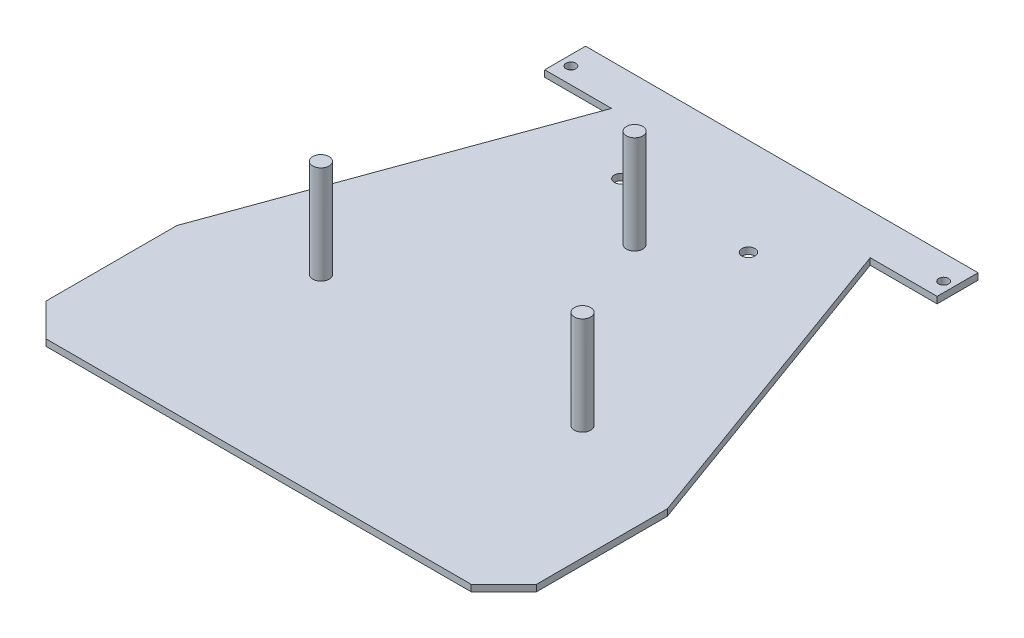
ISO-10303-21;
HEADER;
FILE_DESCRIPTION(('STEP AP214'),'2;1');
FILE_NAME('part.step','',(''),(''),'','','');
FILE_SCHEMA(('AUTOMOTIVE_DESIGN { 1 0 10303 214 1 1 1 1 }'));
ENDSEC;
DATA;
#1=APPLICATION_CONTEXT('core data for automotive mechanical design processes');
#2=APPLICATION_PROTOCOL_DEFINITION('international standard','automotive_design',2000,#1);
#3=PRODUCT_CONTEXT('',#1,'mechanical');
#4=PRODUCT('Part','Part','',(#3));
#5=PRODUCT_RELATED_PRODUCT_CATEGORY('part','',(#4));
#6=PRODUCT_DEFINITION_FORMATION('','',#4);
#7=PRODUCT_DEFINITION_CONTEXT('part definition',#1,'design');
#8=PRODUCT_DEFINITION('design','',#6,#7);
#9=PRODUCT_DEFINITION_SHAPE('','',#8);
#10=(LENGTH_UNIT() NAMED_UNIT(*) SI_UNIT(.MILLI.,.METRE.));
#11=(NAMED_UNIT(*) PLANE_ANGLE_UNIT() SI_UNIT($,.RADIAN.));
#12=(NAMED_UNIT(*) SI_UNIT($,.STERADIAN.) SOLID_ANGLE_UNIT());
#13=UNCERTAINTY_MEASURE_WITH_UNIT(LENGTH_MEASURE(1.E-05),#10,'distance_accuracy_value','');
#14=(GEOMETRIC_REPRESENTATION_CONTEXT(3) GLOBAL_UNCERTAINTY_ASSIGNED_CONTEXT((#13)) GLOBAL_UNIT_ASSIGNED_CONTEXT((#10,
#11,#12)) REPRESENTATION_CONTEXT('',''));
#15=CARTESIAN_POINT('',(0.,0.,0.));
#16=DIRECTION('',(0.,0.,1.));
#17=DIRECTION('',(1.,0.,0.));
#18=AXIS2_PLACEMENT_3D('',#15,#16,#17);
#19=CARTESIAN_POINT('',(-75.,2.,70.));
#20=DIRECTION('',(1.,0.,0.));
#21=DIRECTION('',(0.,0.,-1.));
#22=AXIS2_PLACEMENT_3D('',#19,#20,#21);
#23=PLANE('',#22);
#24=DIRECTION('',(0.,0.,1.));
#25=VECTOR('',#24,1.);
#26=CARTESIAN_POINT('',(-75.,0.,70.));
#27=LINE('',#26,#25);
#28=CARTESIAN_POINT('',(-75.,0.,30.));
#29=VERTEX_POINT('',#28);
#30=CARTESIAN_POINT('',(-75.,0.,70.));
#31=VERTEX_POINT('',#30);
#32=EDGE_CURVE('E194',#29,#31,#27,.T.);
#33=ORIENTED_EDGE('',*,*,#32,.T.);
#34=DIRECTION('',(0.,-1.,0.));
#35=VECTOR('',#34,1.);
#36=CARTESIAN_POINT('',(-75.,2.,70.));
#37=LINE('',#36,#35);
#38=CARTESIAN_POINT('',(-75.,2.,70.));
#39=VERTEX_POINT('',#38);
#40=EDGE_CURVE('E243',#39,#31,#37,.T.);
#41=ORIENTED_EDGE('',*,*,#40,.F.);
#42=DIRECTION('',(0.,0.,1.));
#43=VECTOR('',#42,1.);
#44=CARTESIAN_POINT('',(-75.,2.,70.));
#45=LINE('',#44,#43);
#46=CARTESIAN_POINT('',(-75.,2.,30.));
#47=VERTEX_POINT('',#46);
#48=EDGE_CURVE('E199',#47,#39,#45,.T.);
#49=ORIENTED_EDGE('',*,*,#48,.F.);
#50=DIRECTION('',(0.,-1.,0.));
#51=VECTOR('',#50,1.);
#52=CARTESIAN_POINT('',(-75.,2.,30.));
#53=LINE('',#52,#51);
#54=EDGE_CURVE('E213',#47,#29,#53,.T.);
#55=ORIENTED_EDGE('',*,*,#54,.T.);
#56=EDGE_LOOP('',(#33,#41,#49,#55));
#57=FACE_BOUND('',#56,.T.);
#58=ADVANCED_FACE('F45',(#57),#23,.F.);
#59=CARTESIAN_POINT('',(-75.,2.,70.));
#60=DIRECTION('',(0.707106781186547,0.,-0.707106781186547));
#61=DIRECTION('',(-0.707106781186548,0.,-0.707106781186548));
#62=AXIS2_PLACEMENT_3D('',#59,#60,#61);
#63=PLANE('',#62);
#64=DIRECTION('',(0.707106781186547,0.,0.707106781186547));
#65=VECTOR('',#64,1.);
#66=CARTESIAN_POINT('',(-75.,0.,70.));
#67=LINE('',#66,#65);
#68=CARTESIAN_POINT('',(-65.,0.,80.));
#69=VERTEX_POINT('',#68);
#70=EDGE_CURVE('E216',#31,#69,#67,.T.);
#71=ORIENTED_EDGE('',*,*,#70,.T.);
#72=DIRECTION('',(0.,-1.,0.));
#73=VECTOR('',#72,1.);
#74=CARTESIAN_POINT('',(-65.,2.,80.));
#75=LINE('',#74,#73);
#76=CARTESIAN_POINT('',(-65.,2.,80.));
#77=VERTEX_POINT('',#76);
#78=EDGE_CURVE('E240',#77,#69,#75,.T.);
#79=ORIENTED_EDGE('',*,*,#78,.F.);
#80=DIRECTION('',(0.707106781186547,0.,0.707106781186547));
#81=VECTOR('',#80,1.);
#82=CARTESIAN_POINT('',(-75.,2.,70.));
#83=LINE('',#82,#81);
#84=EDGE_CURVE('E202',#39,#77,#83,.T.);
#85=ORIENTED_EDGE('',*,*,#84,.F.);
#86=ORIENTED_EDGE('',*,*,#40,.T.);
#87=EDGE_LOOP('',(#71,#79,#85,#86));
#88=FACE_BOUND('',#87,.T.);
#89=ADVANCED_FACE('F287',(#88),#63,.F.);
#90=CARTESIAN_POINT('',(-65.,2.,80.));
#91=DIRECTION('',(0.,0.,-1.));
#92=DIRECTION('',(-1.,0.,0.));
#93=AXIS2_PLACEMENT_3D('',#90,#91,#92);
#94=PLANE('',#93);
#95=DIRECTION('',(1.,0.,0.));
#96=VECTOR('',#95,1.);
#97=CARTESIAN_POINT('',(-65.,0.,80.));
#98=LINE('',#97,#96);
#99=CARTESIAN_POINT('',(65.,0.,80.));
#100=VERTEX_POINT('',#99);
#101=EDGE_CURVE('E218',#69,#100,#98,.T.);
#102=ORIENTED_EDGE('',*,*,#101,.T.);
#103=DIRECTION('',(0.,-1.,0.));
#104=VECTOR('',#103,1.);
#105=CARTESIAN_POINT('',(65.,2.,80.));
#106=LINE('',#105,#104);
#107=CARTESIAN_POINT('',(65.,2.,80.));
#108=VERTEX_POINT('',#107);
#109=EDGE_CURVE('E237',#108,#100,#106,.T.);
#110=ORIENTED_EDGE('',*,*,#109,.F.);
#111=DIRECTION('',(1.,0.,0.));
#112=VECTOR('',#111,1.);
#113=CARTESIAN_POINT('',(-65.,2.,80.));
#114=LINE('',#113,#112);
#115=EDGE_CURVE('E205',#77,#108,#114,.T.);
#116=ORIENTED_EDGE('',*,*,#115,.F.);
#117=ORIENTED_EDGE('',*,*,#78,.T.);
#118=EDGE_LOOP('',(#102,#110,#116,#117));
#119=FACE_BOUND('',#118,.T.);
#120=ADVANCED_FACE('F292',(#119),#94,.F.);
#121=CARTESIAN_POINT('',(75.,2.,70.));
#122=DIRECTION('',(-0.707106781186547,0.,-0.707106781186547));
#123=DIRECTION('',(-0.707106781186548,0.,0.707106781186548));
#124=AXIS2_PLACEMENT_3D('',#121,#122,#123);
#125=PLANE('',#124);
#126=DIRECTION('',(0.707106781186547,0.,-0.707106781186547));
#127=VECTOR('',#126,1.);
#128=CARTESIAN_POINT('',(75.,0.,70.));
#129=LINE('',#128,#127);
#130=CARTESIAN_POINT('',(75.,0.,70.));
#131=VERTEX_POINT('',#130);
#132=EDGE_CURVE('E220',#100,#131,#129,.T.);
#133=ORIENTED_EDGE('',*,*,#132,.T.);
#134=DIRECTION('',(0.,-1.,0.));
#135=VECTOR('',#134,1.);
#136=CARTESIAN_POINT('',(75.,2.,70.));
#137=LINE('',#136,#135);
#138=CARTESIAN_POINT('',(75.,2.,70.));
#139=VERTEX_POINT('',#138);
#140=EDGE_CURVE('E234',#139,#131,#137,.T.);
#141=ORIENTED_EDGE('',*,*,#140,.F.);
#142=DIRECTION('',(0.707106781186547,0.,-0.707106781186547));
#143=VECTOR('',#142,1.);
#144=CARTESIAN_POINT('',(75.,2.,70.));
#145=LINE('',#144,#143);
#146=EDGE_CURVE('E207',#108,#139,#145,.T.);
#147=ORIENTED_EDGE('',*,*,#146,.F.);
#148=ORIENTED_EDGE('',*,*,#109,.T.);
#149=EDGE_LOOP('',(#133,#141,#147,#148));
#150=FACE_BOUND('',#149,.T.);
#151=ADVANCED_FACE('F497',(#150),#125,.F.);
#152=CARTESIAN_POINT('',(75.,2.,70.));
#153=DIRECTION('',(-1.,0.,0.));
#154=DIRECTION('',(0.,0.,1.));
#155=AXIS2_PLACEMENT_3D('',#152,#153,#154);
#156=PLANE('',#155);
#157=DIRECTION('',(0.,0.,-1.));
#158=VECTOR('',#157,1.);
#159=CARTESIAN_POINT('',(75.,0.,70.));
#160=LINE('',#159,#158);
#161=CARTESIAN_POINT('',(75.,0.,30.));
#162=VERTEX_POINT('',#161);
#163=EDGE_CURVE('E222',#131,#162,#160,.T.);
#164=ORIENTED_EDGE('',*,*,#163,.T.);
#165=DIRECTION('',(0.,-1.,0.));
#166=VECTOR('',#165,1.);
#167=CARTESIAN_POINT('',(75.,2.,30.));
#168=LINE('',#167,#166);
#169=CARTESIAN_POINT('',(75.,2.,30.));
#170=VERTEX_POINT('',#169);
#171=EDGE_CURVE('E231',#170,#162,#168,.T.);
#172=ORIENTED_EDGE('',*,*,#171,.F.);
#173=DIRECTION('',(0.,0.,-1.));
#174=VECTOR('',#173,1.);
#175=CARTESIAN_POINT('',(75.,2.,70.));
#176=LINE('',#175,#174);
#177=EDGE_CURVE('E209',#139,#170,#176,.T.);
#178=ORIENTED_EDGE('',*,*,#177,.F.);
#179=ORIENTED_EDGE('',*,*,#140,.T.);
#180=EDGE_LOOP('',(#164,#172,#178,#179));
#181=FACE_BOUND('',#180,.T.);
#182=ADVANCED_FACE('F490',(#181),#156,.F.);
#183=CARTESIAN_POINT('',(35.,2.,-80.));
#184=DIRECTION('',(-0.939793423488437,0.,0.341743063086704));
#185=DIRECTION('',(0.341743063086704,0.,0.939793423488437));
#186=AXIS2_PLACEMENT_3D('',#183,#184,#185);
#187=PLANE('',#186);
#188=DIRECTION('',(-0.341743063086704,0.,-0.939793423488437));
#189=VECTOR('',#188,1.);
#190=CARTESIAN_POINT('',(35.,0.,-80.));
#191=LINE('',#190,#189);
#192=CARTESIAN_POINT('',(39.5454545454545,0.,-67.5));
#193=VERTEX_POINT('',#192);
#194=EDGE_CURVE('E224',#162,#193,#191,.T.);
#195=ORIENTED_EDGE('',*,*,#194,.T.);
#196=DIRECTION('',(0.,1.,0.));
#197=VECTOR('',#196,1.);
#198=CARTESIAN_POINT('',(39.5454545454545,2.,-67.5));
#199=LINE('',#198,#197);
#200=CARTESIAN_POINT('',(39.5454545454545,2.,-67.5));
#201=VERTEX_POINT('',#200);
#202=EDGE_CURVE('E67',#193,#201,#199,.T.);
#203=ORIENTED_EDGE('',*,*,#202,.T.);
#204=DIRECTION('',(-0.341743063086704,0.,-0.939793423488437));
#205=VECTOR('',#204,1.);
#206=CARTESIAN_POINT('',(35.,2.,-80.));
#207=LINE('',#206,#205);
#208=EDGE_CURVE('E146',#170,#201,#207,.T.);
#209=ORIENTED_EDGE('',*,*,#208,.F.);
#210=ORIENTED_EDGE('',*,*,#171,.T.);
#211=EDGE_LOOP('',(#195,#203,#209,#210));
#212=FACE_BOUND('',#211,.T.);
#213=ADVANCED_FACE('F467',(#212),#187,.F.);
#214=CARTESIAN_POINT('',(-35.,2.,-80.));
#215=DIRECTION('',(0.,0.,1.));
#216=DIRECTION('',(1.,0.,0.));
#217=AXIS2_PLACEMENT_3D('',#214,#215,#216);
#218=PLANE('',#217);
#219=DIRECTION('',(-1.,0.,0.));
#220=VECTOR('',#219,1.);
#221=CARTESIAN_POINT('',(-35.,0.,-80.));
#222=LINE('',#221,#220);
#223=CARTESIAN_POINT('',(60.,0.,-80.));
#224=VERTEX_POINT('',#223);
#225=CARTESIAN_POINT('',(-60.,0.,-80.));
#226=VERTEX_POINT('',#225);
#227=EDGE_CURVE('E226',#224,#226,#222,.T.);
#228=ORIENTED_EDGE('',*,*,#227,.T.);
#229=DIRECTION('',(0.,-1.,0.));
#230=VECTOR('',#229,1.);
#231=CARTESIAN_POINT('',(-60.,2.,-80.));
#232=LINE('',#231,#230);
#233=CARTESIAN_POINT('',(-60.,2.,-80.));
#234=VERTEX_POINT('',#233);
#235=EDGE_CURVE('E141',#234,#226,#232,.T.);
#236=ORIENTED_EDGE('',*,*,#235,.F.);
#237=DIRECTION('',(-1.,0.,0.));
#238=VECTOR('',#237,1.);
#239=CARTESIAN_POINT('',(-35.,2.,-80.));
#240=LINE('',#239,#238);
#241=CARTESIAN_POINT('',(60.,2.,-80.));
#242=VERTEX_POINT('',#241);
#243=EDGE_CURVE('E135',#242,#234,#240,.T.);
#244=ORIENTED_EDGE('',*,*,#243,.F.);
#245=DIRECTION('',(0.,-1.,0.));
#246=VECTOR('',#245,1.);
#247=CARTESIAN_POINT('',(60.,2.,-80.));
#248=LINE('',#247,#246);
#249=EDGE_CURVE('E138',#242,#224,#248,.T.);
#250=ORIENTED_EDGE('',*,*,#249,.T.);
#251=EDGE_LOOP('',(#228,#236,#244,#250));
#252=FACE_BOUND('',#251,.T.);
#253=ADVANCED_FACE('F137',(#252),#218,.F.);
#254=CARTESIAN_POINT('',(-75.,2.,30.));
#255=DIRECTION('',(0.939793423488437,0.,0.341743063086704));
#256=DIRECTION('',(0.341743063086704,0.,-0.939793423488437));
#257=AXIS2_PLACEMENT_3D('',#254,#255,#256);
#258=PLANE('',#257);
#259=DIRECTION('',(-0.341743063086704,0.,0.939793423488437));
#260=VECTOR('',#259,1.);
#261=CARTESIAN_POINT('',(-75.,2.,30.));
#262=LINE('',#261,#260);
#263=CARTESIAN_POINT('',(-39.5454545454546,2.,-67.5));
#264=VERTEX_POINT('',#263);
#265=EDGE_CURVE('E59',#264,#47,#262,.T.);
#266=ORIENTED_EDGE('',*,*,#265,.F.);
#267=DIRECTION('',(0.,-1.,0.));
#268=VECTOR('',#267,1.);
#269=CARTESIAN_POINT('',(-39.5454545454545,2.,-67.5));
#270=LINE('',#269,#268);
#271=CARTESIAN_POINT('',(-39.5454545454546,0.,-67.5));
#272=VERTEX_POINT('',#271);
#273=EDGE_CURVE('E179',#264,#272,#270,.T.);
#274=ORIENTED_EDGE('',*,*,#273,.T.);
#275=DIRECTION('',(-0.341743063086704,0.,0.939793423488437));
#276=VECTOR('',#275,1.);
#277=CARTESIAN_POINT('',(-75.,0.,30.));
#278=LINE('',#277,#276);
#279=EDGE_CURVE('E203',#272,#29,#278,.T.);
#280=ORIENTED_EDGE('',*,*,#279,.T.);
#281=ORIENTED_EDGE('',*,*,#54,.F.);
#282=EDGE_LOOP('',(#266,#274,#280,#281));
#283=FACE_BOUND('',#282,.T.);
#284=ADVANCED_FACE('F256',(#283),#258,.F.);
#285=CARTESIAN_POINT('',(0.,2.,0.));
#286=DIRECTION('',(0.,-1.,0.));
#287=DIRECTION('',(0.,0.,-1.));
#288=AXIS2_PLACEMENT_3D('',#285,#286,#287);
#289=PLANE('',#288);
#290=CARTESIAN_POINT('',(0.,2.,-35.));
#291=DIRECTION('',(0.,-1.,0.));
#292=DIRECTION('',(0.,0.,-1.));
#293=AXIS2_PLACEMENT_3D('',#290,#291,#292);
#294=CIRCLE('',#293,2.5);
#295=CARTESIAN_POINT('',(0.,2.,-37.5));
#296=VERTEX_POINT('',#295);
#297=EDGE_CURVE('E13',#296,#296,#294,.F.);
#298=ORIENTED_EDGE('',*,*,#297,.F.);
#299=EDGE_LOOP('',(#298));
#300=FACE_BOUND('',#299,.T.);
#301=CARTESIAN_POINT('',(40.,2.,20.9352791960546));
#302=DIRECTION('',(0.,-1.,0.));
#303=DIRECTION('',(0.,0.,-1.));
#304=AXIS2_PLACEMENT_3D('',#301,#302,#303);
#305=CIRCLE('',#304,2.5);
#306=CARTESIAN_POINT('',(40.,2.,18.4352791960546));
#307=VERTEX_POINT('',#306);
#308=EDGE_CURVE('E52',#307,#307,#305,.F.);
#309=ORIENTED_EDGE('',*,*,#308,.F.);
#310=EDGE_LOOP('',(#309));
#311=FACE_BOUND('',#310,.T.);
#312=CARTESIAN_POINT('',(-40.,2.,20.9352791960546));
#313=DIRECTION('',(0.,-1.,0.));
#314=DIRECTION('',(0.,0.,-1.));
#315=AXIS2_PLACEMENT_3D('',#312,#313,#314);
#316=CIRCLE('',#315,2.5);
#317=CARTESIAN_POINT('',(-40.,2.,18.4352791960546));
#318=VERTEX_POINT('',#317);
#319=EDGE_CURVE('E246',#318,#318,#316,.F.);
#320=ORIENTED_EDGE('',*,*,#319,.F.);
#321=EDGE_LOOP('',(#320));
#322=FACE_BOUND('',#321,.T.);
#323=CARTESIAN_POINT('',(57.,2.,-72.5));
#324=DIRECTION('',(0.,1.,0.));
#325=DIRECTION('',(0.,0.,1.));
#326=AXIS2_PLACEMENT_3D('',#323,#324,#325);
#327=CIRCLE('',#326,1.50000000000002);
#328=CARTESIAN_POINT('',(57.,2.,-71.));
#329=VERTEX_POINT('',#328);
#330=EDGE_CURVE('E175',#329,#329,#327,.T.);
#331=ORIENTED_EDGE('',*,*,#330,.F.);
#332=EDGE_LOOP('',(#331));
#333=FACE_BOUND('',#332,.T.);
#334=CARTESIAN_POINT('',(-57.,2.,-72.5));
#335=DIRECTION('',(0.,1.,0.));
#336=DIRECTION('',(0.,0.,1.));
#337=AXIS2_PLACEMENT_3D('',#334,#335,#336);
#338=CIRCLE('',#337,1.50000000000002);
#339=CARTESIAN_POINT('',(-57.,2.,-71.));
#340=VERTEX_POINT('',#339);
#341=EDGE_CURVE('E267',#340,#340,#338,.T.);
#342=ORIENTED_EDGE('',*,*,#341,.F.);
#343=EDGE_LOOP('',(#342));
#344=FACE_BOUND('',#343,.T.);
#345=CARTESIAN_POINT('',(-19.5,2.,-50.3127039898346));
#346=DIRECTION('',(0.,-1.,0.));
#347=DIRECTION('',(0.,0.,-1.));
#348=AXIS2_PLACEMENT_3D('',#345,#346,#347);
#349=CIRCLE('',#348,2.);
#350=CARTESIAN_POINT('',(-19.5,2.,-52.3127039898346));
#351=VERTEX_POINT('',#350);
#352=EDGE_CURVE('E190',#351,#351,#349,.F.);
#353=ORIENTED_EDGE('',*,*,#352,.F.);
#354=EDGE_LOOP('',(#353));
#355=FACE_BOUND('',#354,.T.);
#356=CARTESIAN_POINT('',(19.5,2.,-50.3127039898346));
#357=DIRECTION('',(0.,-1.,0.));
#358=DIRECTION('',(0.,0.,-1.));
#359=AXIS2_PLACEMENT_3D('',#356,#357,#358);
#360=CIRCLE('',#359,2.);
#361=CARTESIAN_POINT('',(19.5,2.,-52.3127039898346));
#362=VERTEX_POINT('',#361);
#363=EDGE_CURVE('E191',#362,#362,#360,.F.);
#364=ORIENTED_EDGE('',*,*,#363,.F.);
#365=EDGE_LOOP('',(#364));
#366=FACE_BOUND('',#365,.T.);
#367=ORIENTED_EDGE('',*,*,#208,.T.);
#368=DIRECTION('',(-1.,0.,0.));
#369=VECTOR('',#368,1.);
#370=CARTESIAN_POINT('',(-60.,2.,-67.5));
#371=LINE('',#370,#369);
#372=CARTESIAN_POINT('',(60.,2.,-67.5));
#373=VERTEX_POINT('',#372);
#374=EDGE_CURVE('E160',#373,#201,#371,.T.);
#375=ORIENTED_EDGE('',*,*,#374,.F.);
#376=DIRECTION('',(0.,0.,1.));
#377=VECTOR('',#376,1.);
#378=CARTESIAN_POINT('',(60.,2.,-67.5));
#379=LINE('',#378,#377);
#380=EDGE_CURVE('E151',#242,#373,#379,.T.);
#381=ORIENTED_EDGE('',*,*,#380,.F.);
#382=ORIENTED_EDGE('',*,*,#243,.T.);
#383=DIRECTION('',(0.,0.,-1.));
#384=VECTOR('',#383,1.);
#385=CARTESIAN_POINT('',(-60.,2.,-80.));
#386=LINE('',#385,#384);
#387=CARTESIAN_POINT('',(-60.,2.,-67.5));
#388=VERTEX_POINT('',#387);
#389=EDGE_CURVE('E155',#388,#234,#386,.T.);
#390=ORIENTED_EDGE('',*,*,#389,.F.);
#391=EDGE_CURVE('E161',#264,#388,#371,.T.);
#392=ORIENTED_EDGE('',*,*,#391,.F.);
#393=ORIENTED_EDGE('',*,*,#265,.T.);
#394=ORIENTED_EDGE('',*,*,#48,.T.);
#395=ORIENTED_EDGE('',*,*,#84,.T.);
#396=ORIENTED_EDGE('',*,*,#115,.T.);
#397=ORIENTED_EDGE('',*,*,#146,.T.);
#398=ORIENTED_EDGE('',*,*,#177,.T.);
#399=EDGE_LOOP('',(#367,#375,#381,#382,#390,#392,#393,#394,#395,#396,#397,#398));
#400=FACE_BOUND('',#399,.T.);
#401=ADVANCED_FACE('F158',(#300,#311,#322,#333,#344,#355,#366,#400),#289,.F.);
#402=CARTESIAN_POINT('',(0.,0.,0.));
#403=DIRECTION('',(0.,-1.,0.));
#404=DIRECTION('',(0.,0.,-1.));
#405=AXIS2_PLACEMENT_3D('',#402,#403,#404);
#406=PLANE('',#405);
#407=CARTESIAN_POINT('',(57.,0.,-72.5));
#408=DIRECTION('',(0.,-1.,0.));
#409=DIRECTION('',(0.,0.,-1.));
#410=AXIS2_PLACEMENT_3D('',#407,#408,#409);
#411=CIRCLE('',#410,1.50000000000002);
#412=CARTESIAN_POINT('',(57.,0.,-74.));
#413=VERTEX_POINT('',#412);
#414=EDGE_CURVE('E337',#413,#413,#411,.F.);
#415=ORIENTED_EDGE('',*,*,#414,.T.);
#416=EDGE_LOOP('',(#415));
#417=FACE_BOUND('',#416,.T.);
#418=CARTESIAN_POINT('',(-57.,0.,-72.5));
#419=DIRECTION('',(0.,-1.,0.));
#420=DIRECTION('',(0.,0.,-1.));
#421=AXIS2_PLACEMENT_3D('',#418,#419,#420);
#422=CIRCLE('',#421,1.50000000000002);
#423=CARTESIAN_POINT('',(-57.,0.,-74.));
#424=VERTEX_POINT('',#423);
#425=EDGE_CURVE('E169',#424,#424,#422,.F.);
#426=ORIENTED_EDGE('',*,*,#425,.T.);
#427=EDGE_LOOP('',(#426));
#428=FACE_BOUND('',#427,.T.);
#429=ORIENTED_EDGE('',*,*,#279,.F.);
#430=DIRECTION('',(-1.,0.,0.));
#431=VECTOR('',#430,1.);
#432=CARTESIAN_POINT('',(-60.,0.,-67.5));
#433=LINE('',#432,#431);
#434=CARTESIAN_POINT('',(-60.,0.,-67.5));
#435=VERTEX_POINT('',#434);
#436=EDGE_CURVE('E174',#272,#435,#433,.T.);
#437=ORIENTED_EDGE('',*,*,#436,.T.);
#438=DIRECTION('',(0.,0.,-1.));
#439=VECTOR('',#438,1.);
#440=CARTESIAN_POINT('',(-60.,0.,-80.));
#441=LINE('',#440,#439);
#442=EDGE_CURVE('E162',#435,#226,#441,.T.);
#443=ORIENTED_EDGE('',*,*,#442,.T.);
#444=ORIENTED_EDGE('',*,*,#227,.F.);
#445=DIRECTION('',(0.,0.,1.));
#446=VECTOR('',#445,1.);
#447=CARTESIAN_POINT('',(60.,0.,-67.5));
#448=LINE('',#447,#446);
#449=CARTESIAN_POINT('',(60.,0.,-67.5));
#450=VERTEX_POINT('',#449);
#451=EDGE_CURVE('E153',#224,#450,#448,.T.);
#452=ORIENTED_EDGE('',*,*,#451,.T.);
#453=EDGE_CURVE('E166',#450,#193,#433,.T.);
#454=ORIENTED_EDGE('',*,*,#453,.T.);
#455=ORIENTED_EDGE('',*,*,#194,.F.);
#456=ORIENTED_EDGE('',*,*,#163,.F.);
#457=ORIENTED_EDGE('',*,*,#132,.F.);
#458=ORIENTED_EDGE('',*,*,#101,.F.);
#459=ORIENTED_EDGE('',*,*,#70,.F.);
#460=ORIENTED_EDGE('',*,*,#32,.F.);
#461=EDGE_LOOP('',(#429,#437,#443,#444,#452,#454,#455,#456,#457,#458,#459,#460));
#462=FACE_BOUND('',#461,.T.);
#463=CARTESIAN_POINT('',(-19.5,0.,-50.3127039898346));
#464=DIRECTION('',(0.,-1.,0.));
#465=DIRECTION('',(0.,0.,-1.));
#466=AXIS2_PLACEMENT_3D('',#463,#464,#465);
#467=CIRCLE('',#466,2.);
#468=CARTESIAN_POINT('',(-19.5,0.,-52.3127039898346));
#469=VERTEX_POINT('',#468);
#470=EDGE_CURVE('E187',#469,#469,#467,.T.);
#471=ORIENTED_EDGE('',*,*,#470,.F.);
#472=EDGE_LOOP('',(#471));
#473=FACE_BOUND('',#472,.T.);
#474=CARTESIAN_POINT('',(19.5,0.,-50.3127039898346));
#475=DIRECTION('',(0.,-1.,0.));
#476=DIRECTION('',(0.,0.,-1.));
#477=AXIS2_PLACEMENT_3D('',#474,#475,#476);
#478=CIRCLE('',#477,2.);
#479=CARTESIAN_POINT('',(19.5,0.,-52.3127039898346));
#480=VERTEX_POINT('',#479);
#481=EDGE_CURVE('E186',#480,#480,#478,.T.);
#482=ORIENTED_EDGE('',*,*,#481,.F.);
#483=EDGE_LOOP('',(#482));
#484=FACE_BOUND('',#483,.T.);
#485=ADVANCED_FACE('F255',(#417,#428,#462,#473,#484),#406,.T.);
#486=CARTESIAN_POINT('',(19.5,2.001,-50.3127039898346));
#487=DIRECTION('',(0.,-1.,0.));
#488=DIRECTION('',(0.,0.,-1.));
#489=AXIS2_PLACEMENT_3D('',#486,#487,#488);
#490=CYLINDRICAL_SURFACE('',#489,2.);
#491=ORIENTED_EDGE('',*,*,#481,.T.);
#492=EDGE_LOOP('',(#491));
#493=FACE_BOUND('',#492,.T.);
#494=ORIENTED_EDGE('',*,*,#363,.T.);
#495=EDGE_LOOP('',(#494));
#496=FACE_BOUND('',#495,.T.);
#497=ADVANCED_FACE('F272',(#493,#496),#490,.F.);
#498=CARTESIAN_POINT('',(-19.5,2.001,-50.3127039898346));
#499=DIRECTION('',(0.,-1.,0.));
#500=DIRECTION('',(0.,0.,-1.));
#501=AXIS2_PLACEMENT_3D('',#498,#499,#500);
#502=CYLINDRICAL_SURFACE('',#501,2.);
#503=ORIENTED_EDGE('',*,*,#470,.T.);
#504=EDGE_LOOP('',(#503));
#505=FACE_BOUND('',#504,.T.);
#506=ORIENTED_EDGE('',*,*,#352,.T.);
#507=EDGE_LOOP('',(#506));
#508=FACE_BOUND('',#507,.T.);
#509=ADVANCED_FACE('F274',(#505,#508),#502,.F.);
#510=CARTESIAN_POINT('',(-60.,2.,-80.));
#511=DIRECTION('',(-1.,0.,0.));
#512=DIRECTION('',(0.,0.,1.));
#513=AXIS2_PLACEMENT_3D('',#510,#511,#512);
#514=PLANE('',#513);
#515=ORIENTED_EDGE('',*,*,#442,.F.);
#516=DIRECTION('',(0.,-1.,0.));
#517=VECTOR('',#516,1.);
#518=CARTESIAN_POINT('',(-60.,2.,-67.5));
#519=LINE('',#518,#517);
#520=EDGE_CURVE('E180',#388,#435,#519,.T.);
#521=ORIENTED_EDGE('',*,*,#520,.F.);
#522=ORIENTED_EDGE('',*,*,#389,.T.);
#523=ORIENTED_EDGE('',*,*,#235,.T.);
#524=EDGE_LOOP('',(#515,#521,#522,#523));
#525=FACE_BOUND('',#524,.T.);
#526=ADVANCED_FACE('F281',(#525),#514,.T.);
#527=CARTESIAN_POINT('',(-60.,2.,-67.5));
#528=DIRECTION('',(0.,0.,1.));
#529=DIRECTION('',(1.,0.,0.));
#530=AXIS2_PLACEMENT_3D('',#527,#528,#529);
#531=PLANE('',#530);
#532=ORIENTED_EDGE('',*,*,#273,.F.);
#533=ORIENTED_EDGE('',*,*,#391,.T.);
#534=ORIENTED_EDGE('',*,*,#520,.T.);
#535=ORIENTED_EDGE('',*,*,#436,.F.);
#536=EDGE_LOOP('',(#532,#533,#534,#535));
#537=FACE_BOUND('',#536,.T.);
#538=ADVANCED_FACE('F306',(#537),#531,.T.);
#539=ORIENTED_EDGE('',*,*,#202,.F.);
#540=ORIENTED_EDGE('',*,*,#453,.F.);
#541=DIRECTION('',(0.,-1.,0.));
#542=VECTOR('',#541,1.);
#543=CARTESIAN_POINT('',(60.,2.,-67.5));
#544=LINE('',#543,#542);
#545=EDGE_CURVE('E154',#373,#450,#544,.T.);
#546=ORIENTED_EDGE('',*,*,#545,.F.);
#547=ORIENTED_EDGE('',*,*,#374,.T.);
#548=EDGE_LOOP('',(#539,#540,#546,#547));
#549=FACE_BOUND('',#548,.T.);
#550=ADVANCED_FACE('F315',(#549),#531,.T.);
#551=CARTESIAN_POINT('',(60.,2.,-67.5));
#552=DIRECTION('',(1.,0.,0.));
#553=DIRECTION('',(0.,0.,-1.));
#554=AXIS2_PLACEMENT_3D('',#551,#552,#553);
#555=PLANE('',#554);
#556=ORIENTED_EDGE('',*,*,#451,.F.);
#557=ORIENTED_EDGE('',*,*,#249,.F.);
#558=ORIENTED_EDGE('',*,*,#380,.T.);
#559=ORIENTED_EDGE('',*,*,#545,.T.);
#560=EDGE_LOOP('',(#556,#557,#558,#559));
#561=FACE_BOUND('',#560,.T.);
#562=ADVANCED_FACE('F150',(#561),#555,.T.);
#563=CARTESIAN_POINT('',(-57.,-0.00100000000000013,-72.5));
#564=DIRECTION('',(0.,1.,0.));
#565=DIRECTION('',(0.,0.,1.));
#566=AXIS2_PLACEMENT_3D('',#563,#564,#565);
#567=CYLINDRICAL_SURFACE('',#566,1.50000000000002);
#568=ORIENTED_EDGE('',*,*,#425,.F.);
#569=EDGE_LOOP('',(#568));
#570=FACE_BOUND('',#569,.T.);
#571=ORIENTED_EDGE('',*,*,#341,.T.);
#572=EDGE_LOOP('',(#571));
#573=FACE_BOUND('',#572,.T.);
#574=ADVANCED_FACE('F318',(#570,#573),#567,.F.);
#575=CARTESIAN_POINT('',(57.,-0.00100000000000013,-72.5));
#576=DIRECTION('',(0.,1.,0.));
#577=DIRECTION('',(0.,0.,1.));
#578=AXIS2_PLACEMENT_3D('',#575,#576,#577);
#579=CYLINDRICAL_SURFACE('',#578,1.50000000000002);
#580=ORIENTED_EDGE('',*,*,#414,.F.);
#581=EDGE_LOOP('',(#580));
#582=FACE_BOUND('',#581,.T.);
#583=ORIENTED_EDGE('',*,*,#330,.T.);
#584=EDGE_LOOP('',(#583));
#585=FACE_BOUND('',#584,.T.);
#586=ADVANCED_FACE('F327',(#582,#585),#579,.F.);
#587=CARTESIAN_POINT('',(-40.,32.,20.9352791960546));
#588=DIRECTION('',(0.,-1.,0.));
#589=DIRECTION('',(0.,0.,-1.));
#590=AXIS2_PLACEMENT_3D('',#587,#588,#589);
#591=CYLINDRICAL_SURFACE('',#590,2.5);
#592=CARTESIAN_POINT('',(-40.,32.,20.9352791960546));
#593=DIRECTION('',(0.,1.,0.));
#594=DIRECTION('',(0.,0.,1.));
#595=AXIS2_PLACEMENT_3D('',#592,#593,#594);
#596=CIRCLE('',#595,2.5);
#597=CARTESIAN_POINT('',(-40.,32.,23.4352791960546));
#598=VERTEX_POINT('',#597);
#599=EDGE_CURVE('E340',#598,#598,#596,.T.);
#600=ORIENTED_EDGE('',*,*,#599,.F.);
#601=EDGE_LOOP('',(#600));
#602=FACE_BOUND('',#601,.T.);
#603=ORIENTED_EDGE('',*,*,#319,.T.);
#604=EDGE_LOOP('',(#603));
#605=FACE_BOUND('',#604,.T.);
#606=ADVANCED_FACE('F332',(#602,#605),#591,.T.);
#607=CARTESIAN_POINT('',(-40.,32.,20.9352791960546));
#608=DIRECTION('',(0.,1.,0.));
#609=DIRECTION('',(0.,0.,1.));
#610=AXIS2_PLACEMENT_3D('',#607,#608,#609);
#611=PLANE('',#610);
#612=ORIENTED_EDGE('',*,*,#599,.T.);
#613=EDGE_LOOP('',(#612));
#614=FACE_BOUND('',#613,.T.);
#615=ADVANCED_FACE('F370',(#614),#611,.T.);
#616=CARTESIAN_POINT('',(40.,32.,20.9352791960546));
#617=DIRECTION('',(0.,-1.,0.));
#618=DIRECTION('',(0.,0.,-1.));
#619=AXIS2_PLACEMENT_3D('',#616,#617,#618);
#620=CYLINDRICAL_SURFACE('',#619,2.5);
#621=CARTESIAN_POINT('',(40.,32.,20.9352791960546));
#622=DIRECTION('',(0.,1.,0.));
#623=DIRECTION('',(0.,0.,1.));
#624=AXIS2_PLACEMENT_3D('',#621,#622,#623);
#625=CIRCLE('',#624,2.5);
#626=CARTESIAN_POINT('',(40.,32.,23.4352791960546));
#627=VERTEX_POINT('',#626);
#628=EDGE_CURVE('E345',#627,#627,#625,.T.);
#629=ORIENTED_EDGE('',*,*,#628,.F.);
#630=EDGE_LOOP('',(#629));
#631=FACE_BOUND('',#630,.T.);
#632=ORIENTED_EDGE('',*,*,#308,.T.);
#633=EDGE_LOOP('',(#632));
#634=FACE_BOUND('',#633,.T.);
#635=ADVANCED_FACE('F251',(#631,#634),#620,.T.);
#636=CARTESIAN_POINT('',(40.,32.,20.9352791960546));
#637=DIRECTION('',(0.,1.,0.));
#638=DIRECTION('',(0.,0.,1.));
#639=AXIS2_PLACEMENT_3D('',#636,#637,#638);
#640=PLANE('',#639);
#641=ORIENTED_EDGE('',*,*,#628,.T.);
#642=EDGE_LOOP('',(#641));
#643=FACE_BOUND('',#642,.T.);
#644=ADVANCED_FACE('F357',(#643),#640,.T.);
#645=CARTESIAN_POINT('',(0.,32.,-35.));
#646=DIRECTION('',(0.,-1.,0.));
#647=DIRECTION('',(0.,0.,-1.));
#648=AXIS2_PLACEMENT_3D('',#645,#646,#647);
#649=CYLINDRICAL_SURFACE('',#648,2.5);
#650=CARTESIAN_POINT('',(0.,32.,-35.));
#651=DIRECTION('',(0.,1.,0.));
#652=DIRECTION('',(0.,0.,1.));
#653=AXIS2_PLACEMENT_3D('',#650,#651,#652);
#654=CIRCLE('',#653,2.5);
#655=CARTESIAN_POINT('',(0.,32.,-32.5));
#656=VERTEX_POINT('',#655);
#657=EDGE_CURVE('E348',#656,#656,#654,.T.);
#658=ORIENTED_EDGE('',*,*,#657,.F.);
#659=EDGE_LOOP('',(#658));
#660=FACE_BOUND('',#659,.T.);
#661=ORIENTED_EDGE('',*,*,#297,.T.);
#662=EDGE_LOOP('',(#661));
#663=FACE_BOUND('',#662,.T.);
#664=ADVANCED_FACE('F354',(#660,#663),#649,.T.);
#665=CARTESIAN_POINT('',(0.,32.,-35.));
#666=DIRECTION('',(0.,1.,0.));
#667=DIRECTION('',(0.,0.,1.));
#668=AXIS2_PLACEMENT_3D('',#665,#666,#667);
#669=PLANE('',#668);
#670=ORIENTED_EDGE('',*,*,#657,.T.);
#671=EDGE_LOOP('',(#670));
#672=FACE_BOUND('',#671,.T.);
#673=ADVANCED_FACE('F352',(#672),#669,.T.);
#674=CLOSED_SHELL('',(#58,#89,#120,#151,#182,#213,#253,#284,#401,#485,#497,#509,#526,#538,#550,
#562,#574,#586,#606,#615,#635,#644,#664,#673));
#675=MANIFOLD_SOLID_BREP('B2',#674);
#676=ADVANCED_BREP_SHAPE_REPRESENTATION('',(#18,#675),#14);
#677=SHAPE_DEFINITION_REPRESENTATION(#9,#676);
ENDSEC;
END-ISO-10303-21;
